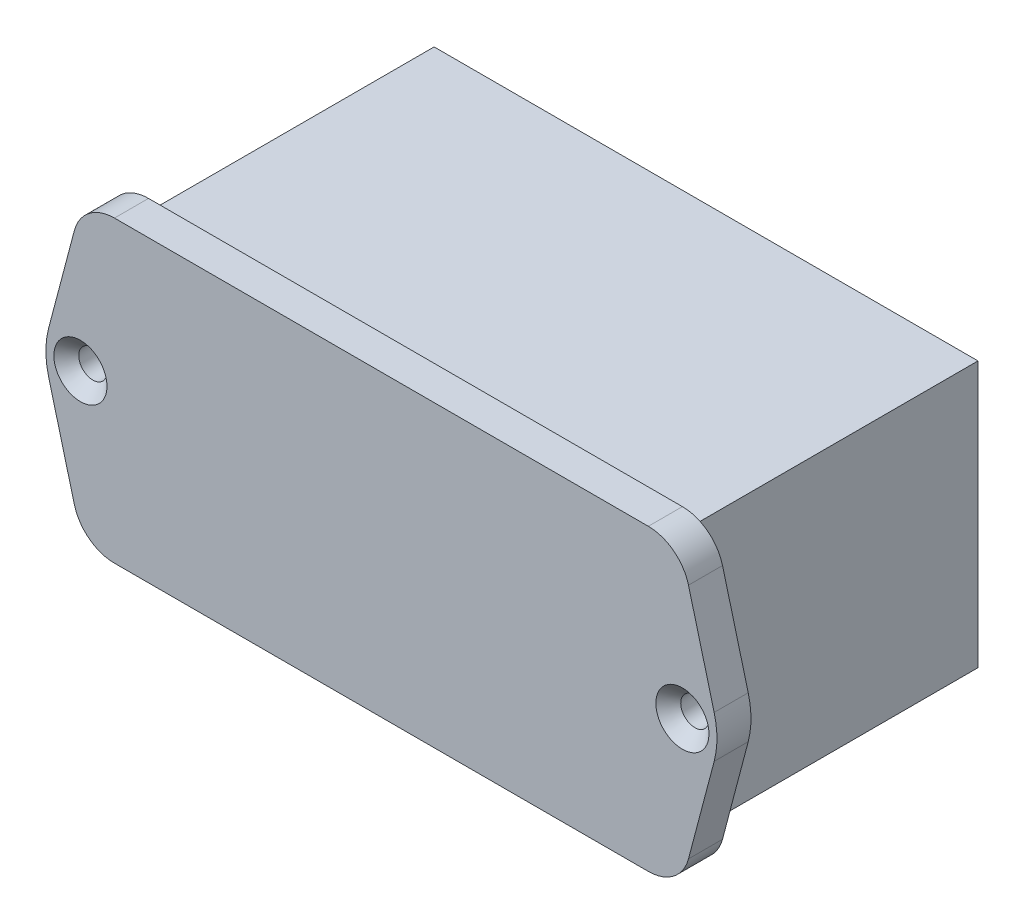
ISO-10303-21;
HEADER;
FILE_DESCRIPTION(('STEP AP214'),'2;1');
FILE_NAME('part.step','',(''),(''),'','','');
FILE_SCHEMA(('AUTOMOTIVE_DESIGN { 1 0 10303 214 1 1 1 1 }'));
ENDSEC;
DATA;
#1=APPLICATION_CONTEXT('core data for automotive mechanical design processes');
#2=APPLICATION_PROTOCOL_DEFINITION('international standard','automotive_design',2000,#1);
#3=PRODUCT_CONTEXT('',#1,'mechanical');
#4=PRODUCT('Part','Part','',(#3));
#5=PRODUCT_RELATED_PRODUCT_CATEGORY('part','',(#4));
#6=PRODUCT_DEFINITION_FORMATION('','',#4);
#7=PRODUCT_DEFINITION_CONTEXT('part definition',#1,'design');
#8=PRODUCT_DEFINITION('design','',#6,#7);
#9=PRODUCT_DEFINITION_SHAPE('','',#8);
#10=(LENGTH_UNIT() NAMED_UNIT(*) SI_UNIT(.MILLI.,.METRE.));
#11=(NAMED_UNIT(*) PLANE_ANGLE_UNIT() SI_UNIT($,.RADIAN.));
#12=(NAMED_UNIT(*) SI_UNIT($,.STERADIAN.) SOLID_ANGLE_UNIT());
#13=UNCERTAINTY_MEASURE_WITH_UNIT(LENGTH_MEASURE(1.E-05),#10,'distance_accuracy_value','');
#14=(GEOMETRIC_REPRESENTATION_CONTEXT(3) GLOBAL_UNCERTAINTY_ASSIGNED_CONTEXT((#13)) GLOBAL_UNIT_ASSIGNED_CONTEXT((#10,
#11,#12)) REPRESENTATION_CONTEXT('',''));
#15=CARTESIAN_POINT('',(0.,0.,0.));
#16=DIRECTION('',(0.,0.,1.));
#17=DIRECTION('',(1.,0.,0.));
#18=AXIS2_PLACEMENT_3D('',#15,#16,#17);
#19=CARTESIAN_POINT('',(-32.1482807802413,13.,-4.1));
#20=DIRECTION('',(0.,0.,-1.));
#21=DIRECTION('',(-1.,0.,0.));
#22=AXIS2_PLACEMENT_3D('',#19,#20,#21);
#23=PLANE('',#22);
#24=CARTESIAN_POINT('',(36.25,0.,-4.1));
#25=DIRECTION('',(0.,0.,1.));
#26=DIRECTION('',(-1.,0.,0.));
#27=AXIS2_PLACEMENT_3D('',#24,#25,#26);
#28=CIRCLE('',#27,1.7);
#29=CARTESIAN_POINT('',(34.55,0.,-4.1));
#30=VERTEX_POINT('',#29);
#31=EDGE_CURVE('E261',#30,#30,#28,.T.);
#32=ORIENTED_EDGE('',*,*,#31,.T.);
#33=EDGE_LOOP('',(#32));
#34=FACE_BOUND('',#33,.T.);
#35=CARTESIAN_POINT('',(-36.25,0.,-4.1));
#36=DIRECTION('',(0.,0.,1.));
#37=DIRECTION('',(1.,0.,0.));
#38=AXIS2_PLACEMENT_3D('',#35,#36,#37);
#39=CIRCLE('',#38,1.7);
#40=CARTESIAN_POINT('',(-34.55,0.,-4.1));
#41=VERTEX_POINT('',#40);
#42=EDGE_CURVE('E264',#41,#41,#39,.T.);
#43=ORIENTED_EDGE('',*,*,#42,.T.);
#44=EDGE_LOOP('',(#43));
#45=FACE_BOUND('',#44,.T.);
#46=CARTESIAN_POINT('',(-32.1482807802413,13.,-4.1));
#47=DIRECTION('',(0.,0.,1.));
#48=DIRECTION('',(-1.,0.,0.));
#49=AXIS2_PLACEMENT_3D('',#46,#47,#48);
#50=CIRCLE('',#49,5.);
#51=CARTESIAN_POINT('',(-32.1482807802412,18.,-4.1));
#52=VERTEX_POINT('',#51);
#53=CARTESIAN_POINT('',(-36.9827825719869,14.2757713061551,-4.1));
#54=VERTEX_POINT('',#53);
#55=EDGE_CURVE('E268',#52,#54,#50,.T.);
#56=ORIENTED_EDGE('',*,*,#55,.F.);
#57=DIRECTION('',(-1.,0.,0.));
#58=VECTOR('',#57,1.);
#59=CARTESIAN_POINT('',(32.1482807802412,18.,-4.1));
#60=LINE('',#59,#58);
#61=CARTESIAN_POINT('',(32.1482807802412,18.,-4.1));
#62=VERTEX_POINT('',#61);
#63=EDGE_CURVE('E302',#62,#52,#60,.T.);
#64=ORIENTED_EDGE('',*,*,#63,.F.);
#65=CARTESIAN_POINT('',(32.1482807802413,13.,-4.1));
#66=DIRECTION('',(0.,0.,1.));
#67=DIRECTION('',(1.,0.,0.));
#68=AXIS2_PLACEMENT_3D('',#65,#66,#67);
#69=CIRCLE('',#68,5.);
#70=CARTESIAN_POINT('',(36.9827825719869,14.2757713061551,-4.1));
#71=VERTEX_POINT('',#70);
#72=EDGE_CURVE('E299',#71,#62,#69,.T.);
#73=ORIENTED_EDGE('',*,*,#72,.F.);
#74=DIRECTION('',(-0.255154261231017,0.966900358349118,0.));
#75=VECTOR('',#74,1.);
#76=CARTESIAN_POINT('',(36.9827825719869,14.2757713061551,-4.1));
#77=LINE('',#76,#75);
#78=CARTESIAN_POINT('',(40.0766762550848,2.55154261231021,-4.1));
#79=VERTEX_POINT('',#78);
#80=EDGE_CURVE('E296',#79,#71,#77,.T.);
#81=ORIENTED_EDGE('',*,*,#80,.F.);
#82=CARTESIAN_POINT('',(30.4076726715936,0.,-4.1));
#83=DIRECTION('',(0.,0.,1.));
#84=DIRECTION('',(1.,0.,0.));
#85=AXIS2_PLACEMENT_3D('',#82,#83,#84);
#86=CIRCLE('',#85,10.);
#87=CARTESIAN_POINT('',(40.0766762550848,-2.55154261231022,-4.1));
#88=VERTEX_POINT('',#87);
#89=EDGE_CURVE('E293',#88,#79,#86,.T.);
#90=ORIENTED_EDGE('',*,*,#89,.F.);
#91=DIRECTION('',(0.255154261231018,0.966900358349118,0.));
#92=VECTOR('',#91,1.);
#93=CARTESIAN_POINT('',(36.9827825719869,-14.2757713061551,-4.1));
#94=LINE('',#93,#92);
#95=CARTESIAN_POINT('',(36.9827825719869,-14.2757713061551,-4.1));
#96=VERTEX_POINT('',#95);
#97=EDGE_CURVE('E290',#96,#88,#94,.T.);
#98=ORIENTED_EDGE('',*,*,#97,.F.);
#99=CARTESIAN_POINT('',(32.1482807802413,-13.,-4.1));
#100=DIRECTION('',(0.,0.,1.));
#101=DIRECTION('',(-1.,0.,0.));
#102=AXIS2_PLACEMENT_3D('',#99,#100,#101);
#103=CIRCLE('',#102,5.);
#104=CARTESIAN_POINT('',(32.1482807802412,-18.,-4.1));
#105=VERTEX_POINT('',#104);
#106=EDGE_CURVE('E287',#105,#96,#103,.T.);
#107=ORIENTED_EDGE('',*,*,#106,.F.);
#108=DIRECTION('',(1.,0.,0.));
#109=VECTOR('',#108,1.);
#110=CARTESIAN_POINT('',(32.1482807802412,-18.,-4.1));
#111=LINE('',#110,#109);
#112=CARTESIAN_POINT('',(-32.1482807802412,-18.,-4.1));
#113=VERTEX_POINT('',#112);
#114=EDGE_CURVE('E284',#113,#105,#111,.T.);
#115=ORIENTED_EDGE('',*,*,#114,.F.);
#116=CARTESIAN_POINT('',(-32.1482807802413,-13.,-4.1));
#117=DIRECTION('',(0.,0.,1.));
#118=DIRECTION('',(1.,0.,0.));
#119=AXIS2_PLACEMENT_3D('',#116,#117,#118);
#120=CIRCLE('',#119,5.);
#121=CARTESIAN_POINT('',(-36.9827825719869,-14.2757713061551,-4.1));
#122=VERTEX_POINT('',#121);
#123=EDGE_CURVE('E281',#122,#113,#120,.T.);
#124=ORIENTED_EDGE('',*,*,#123,.F.);
#125=DIRECTION('',(0.255154261231017,-0.966900358349119,0.));
#126=VECTOR('',#125,1.);
#127=CARTESIAN_POINT('',(-36.9827825719869,-14.2757713061551,-4.1));
#128=LINE('',#127,#126);
#129=CARTESIAN_POINT('',(-40.0766762550848,-2.55154261231022,-4.1));
#130=VERTEX_POINT('',#129);
#131=EDGE_CURVE('E278',#130,#122,#128,.T.);
#132=ORIENTED_EDGE('',*,*,#131,.F.);
#133=CARTESIAN_POINT('',(-30.4076726715936,0.,-4.1));
#134=DIRECTION('',(0.,0.,1.));
#135=DIRECTION('',(-1.,0.,0.));
#136=AXIS2_PLACEMENT_3D('',#133,#134,#135);
#137=CIRCLE('',#136,10.);
#138=CARTESIAN_POINT('',(-40.0766762550848,2.55154261231021,-4.1));
#139=VERTEX_POINT('',#138);
#140=EDGE_CURVE('E275',#139,#130,#137,.T.);
#141=ORIENTED_EDGE('',*,*,#140,.F.);
#142=DIRECTION('',(-0.255154261231017,-0.966900358349118,0.));
#143=VECTOR('',#142,1.);
#144=CARTESIAN_POINT('',(-36.9827825719869,14.2757713061551,-4.1));
#145=LINE('',#144,#143);
#146=EDGE_CURVE('E271',#54,#139,#145,.T.);
#147=ORIENTED_EDGE('',*,*,#146,.F.);
#148=EDGE_LOOP('',(#56,#64,#73,#81,#90,#98,#107,#115,#124,#132,#141,#147));
#149=FACE_BOUND('',#148,.T.);
#150=DIRECTION('',(-1.,0.,0.));
#151=VECTOR('',#150,1.);
#152=CARTESIAN_POINT('',(-32.75,-16.,-4.1));
#153=LINE('',#152,#151);
#154=CARTESIAN_POINT('',(32.75,-16.,-4.1));
#155=VERTEX_POINT('',#154);
#156=CARTESIAN_POINT('',(-32.75,-16.,-4.1));
#157=VERTEX_POINT('',#156);
#158=EDGE_CURVE('E248',#155,#157,#153,.T.);
#159=ORIENTED_EDGE('',*,*,#158,.F.);
#160=DIRECTION('',(0.,-1.,0.));
#161=VECTOR('',#160,1.);
#162=CARTESIAN_POINT('',(32.75,-16.,-4.1));
#163=LINE('',#162,#161);
#164=CARTESIAN_POINT('',(32.75,16.,-4.1));
#165=VERTEX_POINT('',#164);
#166=EDGE_CURVE('E213',#165,#155,#163,.T.);
#167=ORIENTED_EDGE('',*,*,#166,.F.);
#168=DIRECTION('',(1.,0.,0.));
#169=VECTOR('',#168,1.);
#170=CARTESIAN_POINT('',(-32.75,16.,-4.1));
#171=LINE('',#170,#169);
#172=CARTESIAN_POINT('',(-32.75,16.,-4.1));
#173=VERTEX_POINT('',#172);
#174=EDGE_CURVE('E239',#173,#165,#171,.T.);
#175=ORIENTED_EDGE('',*,*,#174,.F.);
#176=DIRECTION('',(0.,1.,0.));
#177=VECTOR('',#176,1.);
#178=CARTESIAN_POINT('',(-32.75,-16.,-4.1));
#179=LINE('',#178,#177);
#180=EDGE_CURVE('E250',#157,#173,#179,.T.);
#181=ORIENTED_EDGE('',*,*,#180,.F.);
#182=EDGE_LOOP('',(#159,#167,#175,#181));
#183=FACE_BOUND('',#182,.T.);
#184=ADVANCED_FACE('F57',(#34,#45,#149,#183),#23,.T.);
#185=CARTESIAN_POINT('',(-32.1482807802413,13.,-4.1));
#186=DIRECTION('',(0.,0.,1.));
#187=DIRECTION('',(1.,0.,0.));
#188=AXIS2_PLACEMENT_3D('',#185,#186,#187);
#189=CYLINDRICAL_SURFACE('',#188,5.);
#190=CARTESIAN_POINT('',(-32.1482807802413,13.,0.));
#191=DIRECTION('',(0.,0.,1.));
#192=DIRECTION('',(-1.,0.,0.));
#193=AXIS2_PLACEMENT_3D('',#190,#191,#192);
#194=CIRCLE('',#193,5.);
#195=CARTESIAN_POINT('',(-32.1482807802412,18.,0.));
#196=VERTEX_POINT('',#195);
#197=CARTESIAN_POINT('',(-36.9827825719869,14.2757713061551,0.));
#198=VERTEX_POINT('',#197);
#199=EDGE_CURVE('E267',#196,#198,#194,.T.);
#200=ORIENTED_EDGE('',*,*,#199,.F.);
#201=DIRECTION('',(0.,0.,1.));
#202=VECTOR('',#201,1.);
#203=CARTESIAN_POINT('',(-32.1482807802412,18.,-4.1));
#204=LINE('',#203,#202);
#205=EDGE_CURVE('E340',#52,#196,#204,.T.);
#206=ORIENTED_EDGE('',*,*,#205,.F.);
#207=ORIENTED_EDGE('',*,*,#55,.T.);
#208=DIRECTION('',(0.,0.,1.));
#209=VECTOR('',#208,1.);
#210=CARTESIAN_POINT('',(-36.9827825719869,14.2757713061551,-4.1));
#211=LINE('',#210,#209);
#212=EDGE_CURVE('E305',#54,#198,#211,.T.);
#213=ORIENTED_EDGE('',*,*,#212,.T.);
#214=EDGE_LOOP('',(#200,#206,#207,#213));
#215=FACE_BOUND('',#214,.T.);
#216=ADVANCED_FACE('F389',(#215),#189,.T.);
#217=CARTESIAN_POINT('',(32.1482807802412,18.,-4.1));
#218=DIRECTION('',(0.,1.,0.));
#219=DIRECTION('',(0.,0.,1.));
#220=AXIS2_PLACEMENT_3D('',#217,#218,#219);
#221=PLANE('',#220);
#222=DIRECTION('',(-1.,0.,0.));
#223=VECTOR('',#222,1.);
#224=CARTESIAN_POINT('',(32.1482807802412,18.,0.));
#225=LINE('',#224,#223);
#226=CARTESIAN_POINT('',(32.1482807802412,18.,0.));
#227=VERTEX_POINT('',#226);
#228=EDGE_CURVE('E272',#227,#196,#225,.T.);
#229=ORIENTED_EDGE('',*,*,#228,.F.);
#230=DIRECTION('',(0.,0.,1.));
#231=VECTOR('',#230,1.);
#232=CARTESIAN_POINT('',(32.1482807802412,18.,-4.1));
#233=LINE('',#232,#231);
#234=EDGE_CURVE('E343',#62,#227,#233,.T.);
#235=ORIENTED_EDGE('',*,*,#234,.F.);
#236=ORIENTED_EDGE('',*,*,#63,.T.);
#237=ORIENTED_EDGE('',*,*,#205,.T.);
#238=EDGE_LOOP('',(#229,#235,#236,#237));
#239=FACE_BOUND('',#238,.T.);
#240=ADVANCED_FACE('F436',(#239),#221,.T.);
#241=CARTESIAN_POINT('',(32.1482807802413,13.,-4.1));
#242=DIRECTION('',(0.,0.,1.));
#243=DIRECTION('',(1.,0.,0.));
#244=AXIS2_PLACEMENT_3D('',#241,#242,#243);
#245=CYLINDRICAL_SURFACE('',#244,5.);
#246=CARTESIAN_POINT('',(32.1482807802413,13.,0.));
#247=DIRECTION('',(0.,0.,1.));
#248=DIRECTION('',(1.,0.,0.));
#249=AXIS2_PLACEMENT_3D('',#246,#247,#248);
#250=CIRCLE('',#249,5.);
#251=CARTESIAN_POINT('',(36.9827825719869,14.2757713061551,0.));
#252=VERTEX_POINT('',#251);
#253=EDGE_CURVE('E335',#252,#227,#250,.T.);
#254=ORIENTED_EDGE('',*,*,#253,.F.);
#255=DIRECTION('',(0.,0.,1.));
#256=VECTOR('',#255,1.);
#257=CARTESIAN_POINT('',(36.9827825719869,14.2757713061551,-4.1));
#258=LINE('',#257,#256);
#259=EDGE_CURVE('E345',#71,#252,#258,.T.);
#260=ORIENTED_EDGE('',*,*,#259,.F.);
#261=ORIENTED_EDGE('',*,*,#72,.T.);
#262=ORIENTED_EDGE('',*,*,#234,.T.);
#263=EDGE_LOOP('',(#254,#260,#261,#262));
#264=FACE_BOUND('',#263,.T.);
#265=ADVANCED_FACE('F439',(#264),#245,.T.);
#266=CARTESIAN_POINT('',(36.9827825719869,14.2757713061551,-4.1));
#267=DIRECTION('',(0.966900358349119,0.255154261231017,0.));
#268=DIRECTION('',(-0.255154261231017,0.966900358349119,0.));
#269=AXIS2_PLACEMENT_3D('',#266,#267,#268);
#270=PLANE('',#269);
#271=DIRECTION('',(-0.255154261231017,0.966900358349118,0.));
#272=VECTOR('',#271,1.);
#273=CARTESIAN_POINT('',(36.9827825719869,14.2757713061551,0.));
#274=LINE('',#273,#272);
#275=CARTESIAN_POINT('',(40.0766762550848,2.55154261231021,0.));
#276=VERTEX_POINT('',#275);
#277=EDGE_CURVE('E332',#276,#252,#274,.T.);
#278=ORIENTED_EDGE('',*,*,#277,.F.);
#279=DIRECTION('',(0.,0.,1.));
#280=VECTOR('',#279,1.);
#281=CARTESIAN_POINT('',(40.0766762550848,2.55154261231021,-4.1));
#282=LINE('',#281,#280);
#283=EDGE_CURVE('E347',#79,#276,#282,.T.);
#284=ORIENTED_EDGE('',*,*,#283,.F.);
#285=ORIENTED_EDGE('',*,*,#80,.T.);
#286=ORIENTED_EDGE('',*,*,#259,.T.);
#287=EDGE_LOOP('',(#278,#284,#285,#286));
#288=FACE_BOUND('',#287,.T.);
#289=ADVANCED_FACE('F443',(#288),#270,.T.);
#290=CARTESIAN_POINT('',(30.4076726715936,0.,-4.1));
#291=DIRECTION('',(0.,0.,1.));
#292=DIRECTION('',(1.,0.,0.));
#293=AXIS2_PLACEMENT_3D('',#290,#291,#292);
#294=CYLINDRICAL_SURFACE('',#293,10.);
#295=CARTESIAN_POINT('',(30.4076726715936,0.,0.));
#296=DIRECTION('',(0.,0.,1.));
#297=DIRECTION('',(1.,0.,0.));
#298=AXIS2_PLACEMENT_3D('',#295,#296,#297);
#299=CIRCLE('',#298,10.);
#300=CARTESIAN_POINT('',(40.0766762550848,-2.55154261231022,0.));
#301=VERTEX_POINT('',#300);
#302=EDGE_CURVE('E329',#301,#276,#299,.T.);
#303=ORIENTED_EDGE('',*,*,#302,.F.);
#304=DIRECTION('',(0.,0.,1.));
#305=VECTOR('',#304,1.);
#306=CARTESIAN_POINT('',(40.0766762550848,-2.55154261231022,-4.1));
#307=LINE('',#306,#305);
#308=EDGE_CURVE('E349',#88,#301,#307,.T.);
#309=ORIENTED_EDGE('',*,*,#308,.F.);
#310=ORIENTED_EDGE('',*,*,#89,.T.);
#311=ORIENTED_EDGE('',*,*,#283,.T.);
#312=EDGE_LOOP('',(#303,#309,#310,#311));
#313=FACE_BOUND('',#312,.T.);
#314=ADVANCED_FACE('F447',(#313),#294,.T.);
#315=CARTESIAN_POINT('',(36.9827825719869,-14.2757713061551,-4.1));
#316=DIRECTION('',(0.966900358349118,-0.255154261231018,0.));
#317=DIRECTION('',(0.255154261231018,0.966900358349119,0.));
#318=AXIS2_PLACEMENT_3D('',#315,#316,#317);
#319=PLANE('',#318);
#320=DIRECTION('',(0.255154261231018,0.966900358349118,0.));
#321=VECTOR('',#320,1.);
#322=CARTESIAN_POINT('',(36.9827825719869,-14.2757713061551,0.));
#323=LINE('',#322,#321);
#324=CARTESIAN_POINT('',(36.9827825719869,-14.2757713061551,0.));
#325=VERTEX_POINT('',#324);
#326=EDGE_CURVE('E326',#325,#301,#323,.T.);
#327=ORIENTED_EDGE('',*,*,#326,.F.);
#328=DIRECTION('',(0.,0.,1.));
#329=VECTOR('',#328,1.);
#330=CARTESIAN_POINT('',(36.9827825719869,-14.2757713061551,-4.1));
#331=LINE('',#330,#329);
#332=EDGE_CURVE('E351',#96,#325,#331,.T.);
#333=ORIENTED_EDGE('',*,*,#332,.F.);
#334=ORIENTED_EDGE('',*,*,#97,.T.);
#335=ORIENTED_EDGE('',*,*,#308,.T.);
#336=EDGE_LOOP('',(#327,#333,#334,#335));
#337=FACE_BOUND('',#336,.T.);
#338=ADVANCED_FACE('F451',(#337),#319,.T.);
#339=CARTESIAN_POINT('',(32.1482807802413,-13.,-4.1));
#340=DIRECTION('',(0.,0.,1.));
#341=DIRECTION('',(1.,0.,0.));
#342=AXIS2_PLACEMENT_3D('',#339,#340,#341);
#343=CYLINDRICAL_SURFACE('',#342,5.);
#344=CARTESIAN_POINT('',(32.1482807802413,-13.,0.));
#345=DIRECTION('',(0.,0.,1.));
#346=DIRECTION('',(-1.,0.,0.));
#347=AXIS2_PLACEMENT_3D('',#344,#345,#346);
#348=CIRCLE('',#347,5.);
#349=CARTESIAN_POINT('',(32.1482807802412,-18.,0.));
#350=VERTEX_POINT('',#349);
#351=EDGE_CURVE('E323',#350,#325,#348,.T.);
#352=ORIENTED_EDGE('',*,*,#351,.F.);
#353=DIRECTION('',(0.,0.,1.));
#354=VECTOR('',#353,1.);
#355=CARTESIAN_POINT('',(32.1482807802412,-18.,-4.1));
#356=LINE('',#355,#354);
#357=EDGE_CURVE('E353',#105,#350,#356,.T.);
#358=ORIENTED_EDGE('',*,*,#357,.F.);
#359=ORIENTED_EDGE('',*,*,#106,.T.);
#360=ORIENTED_EDGE('',*,*,#332,.T.);
#361=EDGE_LOOP('',(#352,#358,#359,#360));
#362=FACE_BOUND('',#361,.T.);
#363=ADVANCED_FACE('F455',(#362),#343,.T.);
#364=CARTESIAN_POINT('',(32.1482807802412,-18.,-4.1));
#365=DIRECTION('',(0.,-1.,0.));
#366=DIRECTION('',(1.,0.,0.));
#367=AXIS2_PLACEMENT_3D('',#364,#365,#366);
#368=PLANE('',#367);
#369=DIRECTION('',(1.,0.,0.));
#370=VECTOR('',#369,1.);
#371=CARTESIAN_POINT('',(32.1482807802412,-18.,0.));
#372=LINE('',#371,#370);
#373=CARTESIAN_POINT('',(-32.1482807802412,-18.,0.));
#374=VERTEX_POINT('',#373);
#375=EDGE_CURVE('E320',#374,#350,#372,.T.);
#376=ORIENTED_EDGE('',*,*,#375,.F.);
#377=DIRECTION('',(0.,0.,1.));
#378=VECTOR('',#377,1.);
#379=CARTESIAN_POINT('',(-32.1482807802412,-18.,-4.1));
#380=LINE('',#379,#378);
#381=EDGE_CURVE('E355',#113,#374,#380,.T.);
#382=ORIENTED_EDGE('',*,*,#381,.F.);
#383=ORIENTED_EDGE('',*,*,#114,.T.);
#384=ORIENTED_EDGE('',*,*,#357,.T.);
#385=EDGE_LOOP('',(#376,#382,#383,#384));
#386=FACE_BOUND('',#385,.T.);
#387=ADVANCED_FACE('F459',(#386),#368,.T.);
#388=CARTESIAN_POINT('',(-32.1482807802413,-13.,-4.1));
#389=DIRECTION('',(0.,0.,1.));
#390=DIRECTION('',(1.,0.,0.));
#391=AXIS2_PLACEMENT_3D('',#388,#389,#390);
#392=CYLINDRICAL_SURFACE('',#391,5.);
#393=CARTESIAN_POINT('',(-32.1482807802413,-13.,0.));
#394=DIRECTION('',(0.,0.,1.));
#395=DIRECTION('',(1.,0.,0.));
#396=AXIS2_PLACEMENT_3D('',#393,#394,#395);
#397=CIRCLE('',#396,5.);
#398=CARTESIAN_POINT('',(-36.9827825719869,-14.2757713061551,0.));
#399=VERTEX_POINT('',#398);
#400=EDGE_CURVE('E317',#399,#374,#397,.T.);
#401=ORIENTED_EDGE('',*,*,#400,.F.);
#402=DIRECTION('',(0.,0.,1.));
#403=VECTOR('',#402,1.);
#404=CARTESIAN_POINT('',(-36.9827825719869,-14.2757713061551,-4.1));
#405=LINE('',#404,#403);
#406=EDGE_CURVE('E357',#122,#399,#405,.T.);
#407=ORIENTED_EDGE('',*,*,#406,.F.);
#408=ORIENTED_EDGE('',*,*,#123,.T.);
#409=ORIENTED_EDGE('',*,*,#381,.T.);
#410=EDGE_LOOP('',(#401,#407,#408,#409));
#411=FACE_BOUND('',#410,.T.);
#412=ADVANCED_FACE('F463',(#411),#392,.T.);
#413=CARTESIAN_POINT('',(-36.9827825719869,-14.2757713061551,-4.1));
#414=DIRECTION('',(-0.966900358349119,-0.255154261231017,0.));
#415=DIRECTION('',(0.255154261231017,-0.966900358349119,0.));
#416=AXIS2_PLACEMENT_3D('',#413,#414,#415);
#417=PLANE('',#416);
#418=DIRECTION('',(0.255154261231017,-0.966900358349119,0.));
#419=VECTOR('',#418,1.);
#420=CARTESIAN_POINT('',(-36.9827825719869,-14.2757713061551,0.));
#421=LINE('',#420,#419);
#422=CARTESIAN_POINT('',(-40.0766762550848,-2.55154261231022,0.));
#423=VERTEX_POINT('',#422);
#424=EDGE_CURVE('E314',#423,#399,#421,.T.);
#425=ORIENTED_EDGE('',*,*,#424,.F.);
#426=DIRECTION('',(0.,0.,1.));
#427=VECTOR('',#426,1.);
#428=CARTESIAN_POINT('',(-40.0766762550848,-2.55154261231022,-4.1));
#429=LINE('',#428,#427);
#430=EDGE_CURVE('E359',#130,#423,#429,.T.);
#431=ORIENTED_EDGE('',*,*,#430,.F.);
#432=ORIENTED_EDGE('',*,*,#131,.T.);
#433=ORIENTED_EDGE('',*,*,#406,.T.);
#434=EDGE_LOOP('',(#425,#431,#432,#433));
#435=FACE_BOUND('',#434,.T.);
#436=ADVANCED_FACE('F467',(#435),#417,.T.);
#437=CARTESIAN_POINT('',(-30.4076726715936,0.,-4.1));
#438=DIRECTION('',(0.,0.,1.));
#439=DIRECTION('',(1.,0.,0.));
#440=AXIS2_PLACEMENT_3D('',#437,#438,#439);
#441=CYLINDRICAL_SURFACE('',#440,10.);
#442=CARTESIAN_POINT('',(-30.4076726715936,0.,0.));
#443=DIRECTION('',(0.,0.,1.));
#444=DIRECTION('',(-1.,0.,0.));
#445=AXIS2_PLACEMENT_3D('',#442,#443,#444);
#446=CIRCLE('',#445,10.);
#447=CARTESIAN_POINT('',(-40.0766762550848,2.55154261231021,0.));
#448=VERTEX_POINT('',#447);
#449=EDGE_CURVE('E311',#448,#423,#446,.T.);
#450=ORIENTED_EDGE('',*,*,#449,.F.);
#451=DIRECTION('',(0.,0.,1.));
#452=VECTOR('',#451,1.);
#453=CARTESIAN_POINT('',(-40.0766762550848,2.55154261231021,-4.1));
#454=LINE('',#453,#452);
#455=EDGE_CURVE('E361',#139,#448,#454,.T.);
#456=ORIENTED_EDGE('',*,*,#455,.F.);
#457=ORIENTED_EDGE('',*,*,#140,.T.);
#458=ORIENTED_EDGE('',*,*,#430,.T.);
#459=EDGE_LOOP('',(#450,#456,#457,#458));
#460=FACE_BOUND('',#459,.T.);
#461=ADVANCED_FACE('F471',(#460),#441,.T.);
#462=CARTESIAN_POINT('',(-36.9827825719869,14.2757713061551,-4.1));
#463=DIRECTION('',(-0.966900358349119,0.255154261231017,0.));
#464=DIRECTION('',(-0.255154261231017,-0.966900358349119,0.));
#465=AXIS2_PLACEMENT_3D('',#462,#463,#464);
#466=PLANE('',#465);
#467=DIRECTION('',(-0.255154261231017,-0.966900358349118,0.));
#468=VECTOR('',#467,1.);
#469=CARTESIAN_POINT('',(-36.9827825719869,14.2757713061551,0.));
#470=LINE('',#469,#468);
#471=EDGE_CURVE('E308',#198,#448,#470,.T.);
#472=ORIENTED_EDGE('',*,*,#471,.F.);
#473=ORIENTED_EDGE('',*,*,#212,.F.);
#474=ORIENTED_EDGE('',*,*,#146,.T.);
#475=ORIENTED_EDGE('',*,*,#455,.T.);
#476=EDGE_LOOP('',(#472,#473,#474,#475));
#477=FACE_BOUND('',#476,.T.);
#478=ADVANCED_FACE('F435',(#477),#466,.T.);
#479=CARTESIAN_POINT('',(-32.1482807802413,13.,0.));
#480=DIRECTION('',(0.,0.,-1.));
#481=DIRECTION('',(-1.,0.,0.));
#482=AXIS2_PLACEMENT_3D('',#479,#480,#481);
#483=PLANE('',#482);
#484=CARTESIAN_POINT('',(36.25,0.,0.));
#485=DIRECTION('',(0.,0.,-1.));
#486=DIRECTION('',(-1.,0.,0.));
#487=AXIS2_PLACEMENT_3D('',#484,#485,#486);
#488=CIRCLE('',#487,3.20000000000001);
#489=CARTESIAN_POINT('',(33.05,0.,0.));
#490=VERTEX_POINT('',#489);
#491=EDGE_CURVE('E65',#490,#490,#488,.T.);
#492=ORIENTED_EDGE('',*,*,#491,.T.);
#493=EDGE_LOOP('',(#492));
#494=FACE_BOUND('',#493,.T.);
#495=CARTESIAN_POINT('',(-36.25,0.,0.));
#496=DIRECTION('',(0.,0.,-1.));
#497=DIRECTION('',(-1.,0.,0.));
#498=AXIS2_PLACEMENT_3D('',#495,#496,#497);
#499=CIRCLE('',#498,3.20000000000001);
#500=CARTESIAN_POINT('',(-39.45,0.,0.));
#501=VERTEX_POINT('',#500);
#502=EDGE_CURVE('E366',#501,#501,#499,.T.);
#503=ORIENTED_EDGE('',*,*,#502,.T.);
#504=EDGE_LOOP('',(#503));
#505=FACE_BOUND('',#504,.T.);
#506=ORIENTED_EDGE('',*,*,#199,.T.);
#507=ORIENTED_EDGE('',*,*,#471,.T.);
#508=ORIENTED_EDGE('',*,*,#449,.T.);
#509=ORIENTED_EDGE('',*,*,#424,.T.);
#510=ORIENTED_EDGE('',*,*,#400,.T.);
#511=ORIENTED_EDGE('',*,*,#375,.T.);
#512=ORIENTED_EDGE('',*,*,#351,.T.);
#513=ORIENTED_EDGE('',*,*,#326,.T.);
#514=ORIENTED_EDGE('',*,*,#302,.T.);
#515=ORIENTED_EDGE('',*,*,#277,.T.);
#516=ORIENTED_EDGE('',*,*,#253,.T.);
#517=ORIENTED_EDGE('',*,*,#228,.T.);
#518=EDGE_LOOP('',(#506,#507,#508,#509,#510,#511,#512,#513,#514,#515,#516,#517));
#519=FACE_BOUND('',#518,.T.);
#520=ADVANCED_FACE('F371',(#494,#505,#519),#483,.F.);
#521=CARTESIAN_POINT('',(-36.25,0.,-4.1));
#522=DIRECTION('',(0.,0.,1.));
#523=DIRECTION('',(1.,0.,0.));
#524=AXIS2_PLACEMENT_3D('',#521,#522,#523);
#525=CYLINDRICAL_SURFACE('',#524,1.7);
#526=CARTESIAN_POINT('',(-36.25,0.,-1.5));
#527=DIRECTION('',(0.,0.,-1.));
#528=DIRECTION('',(-1.,0.,0.));
#529=AXIS2_PLACEMENT_3D('',#526,#527,#528);
#530=CIRCLE('',#529,1.7);
#531=CARTESIAN_POINT('',(-37.95,0.,-1.5));
#532=VERTEX_POINT('',#531);
#533=EDGE_CURVE('E12',#532,#532,#530,.F.);
#534=ORIENTED_EDGE('',*,*,#533,.T.);
#535=EDGE_LOOP('',(#534));
#536=FACE_BOUND('',#535,.T.);
#537=ORIENTED_EDGE('',*,*,#42,.F.);
#538=EDGE_LOOP('',(#537));
#539=FACE_BOUND('',#538,.T.);
#540=ADVANCED_FACE('F383',(#536,#539),#525,.F.);
#541=CARTESIAN_POINT('',(36.25,0.,-4.1));
#542=DIRECTION('',(0.,0.,1.));
#543=DIRECTION('',(1.,0.,0.));
#544=AXIS2_PLACEMENT_3D('',#541,#542,#543);
#545=CYLINDRICAL_SURFACE('',#544,1.7);
#546=CARTESIAN_POINT('',(36.25,0.,-1.5));
#547=DIRECTION('',(0.,0.,-1.));
#548=DIRECTION('',(-1.,0.,0.));
#549=AXIS2_PLACEMENT_3D('',#546,#547,#548);
#550=CIRCLE('',#549,1.7);
#551=CARTESIAN_POINT('',(34.55,0.,-1.5));
#552=VERTEX_POINT('',#551);
#553=EDGE_CURVE('E342',#552,#552,#550,.F.);
#554=ORIENTED_EDGE('',*,*,#553,.T.);
#555=EDGE_LOOP('',(#554));
#556=FACE_BOUND('',#555,.T.);
#557=ORIENTED_EDGE('',*,*,#31,.F.);
#558=EDGE_LOOP('',(#557));
#559=FACE_BOUND('',#558,.T.);
#560=ADVANCED_FACE('F380',(#556,#559),#545,.F.);
#561=CARTESIAN_POINT('',(0.,0.,-39.1));
#562=DIRECTION('',(0.,0.,-1.));
#563=DIRECTION('',(-1.,0.,0.));
#564=AXIS2_PLACEMENT_3D('',#561,#562,#563);
#565=PLANE('',#564);
#566=DIRECTION('',(0.,-1.,0.));
#567=VECTOR('',#566,1.);
#568=CARTESIAN_POINT('',(32.75,-16.,-39.1));
#569=LINE('',#568,#567);
#570=CARTESIAN_POINT('',(32.75,16.,-39.1));
#571=VERTEX_POINT('',#570);
#572=CARTESIAN_POINT('',(32.75,-16.,-39.1));
#573=VERTEX_POINT('',#572);
#574=EDGE_CURVE('E235',#571,#573,#569,.T.);
#575=ORIENTED_EDGE('',*,*,#574,.T.);
#576=DIRECTION('',(-1.,0.,0.));
#577=VECTOR('',#576,1.);
#578=CARTESIAN_POINT('',(-32.75,-16.,-39.1));
#579=LINE('',#578,#577);
#580=CARTESIAN_POINT('',(-32.75,-16.,-39.1));
#581=VERTEX_POINT('',#580);
#582=EDGE_CURVE('E238',#573,#581,#579,.T.);
#583=ORIENTED_EDGE('',*,*,#582,.T.);
#584=DIRECTION('',(0.,1.,0.));
#585=VECTOR('',#584,1.);
#586=CARTESIAN_POINT('',(-32.75,-16.,-39.1));
#587=LINE('',#586,#585);
#588=CARTESIAN_POINT('',(-32.75,16.,-39.1));
#589=VERTEX_POINT('',#588);
#590=EDGE_CURVE('E241',#581,#589,#587,.T.);
#591=ORIENTED_EDGE('',*,*,#590,.T.);
#592=DIRECTION('',(1.,0.,0.));
#593=VECTOR('',#592,1.);
#594=CARTESIAN_POINT('',(-32.75,16.,-39.1));
#595=LINE('',#594,#593);
#596=EDGE_CURVE('E243',#589,#571,#595,.T.);
#597=ORIENTED_EDGE('',*,*,#596,.T.);
#598=EDGE_LOOP('',(#575,#583,#591,#597));
#599=FACE_BOUND('',#598,.T.);
#600=DIRECTION('',(-1.,0.,0.));
#601=VECTOR('',#600,1.);
#602=CARTESIAN_POINT('',(-32.75,-15.,-39.1));
#603=LINE('',#602,#601);
#604=CARTESIAN_POINT('',(31.75,-15.,-39.1));
#605=VERTEX_POINT('',#604);
#606=CARTESIAN_POINT('',(-31.75,-15.,-39.1));
#607=VERTEX_POINT('',#606);
#608=EDGE_CURVE('E205',#605,#607,#603,.T.);
#609=ORIENTED_EDGE('',*,*,#608,.F.);
#610=DIRECTION('',(0.,-1.,0.));
#611=VECTOR('',#610,1.);
#612=CARTESIAN_POINT('',(31.75,-16.,-39.1));
#613=LINE('',#612,#611);
#614=CARTESIAN_POINT('',(31.75,15.,-39.1));
#615=VERTEX_POINT('',#614);
#616=EDGE_CURVE('E196',#615,#605,#613,.T.);
#617=ORIENTED_EDGE('',*,*,#616,.F.);
#618=DIRECTION('',(1.,0.,0.));
#619=VECTOR('',#618,1.);
#620=CARTESIAN_POINT('',(-32.75,15.,-39.1));
#621=LINE('',#620,#619);
#622=CARTESIAN_POINT('',(-31.75,15.,-39.1));
#623=VERTEX_POINT('',#622);
#624=EDGE_CURVE('E221',#623,#615,#621,.T.);
#625=ORIENTED_EDGE('',*,*,#624,.F.);
#626=DIRECTION('',(0.,1.,0.));
#627=VECTOR('',#626,1.);
#628=CARTESIAN_POINT('',(-31.75,-16.,-39.1));
#629=LINE('',#628,#627);
#630=EDGE_CURVE('E219',#607,#623,#629,.T.);
#631=ORIENTED_EDGE('',*,*,#630,.F.);
#632=EDGE_LOOP('',(#609,#617,#625,#631));
#633=FACE_BOUND('',#632,.T.);
#634=ADVANCED_FACE('F217',(#599,#633),#565,.T.);
#635=CARTESIAN_POINT('',(32.75,-16.,-39.1));
#636=DIRECTION('',(-1.,0.,0.));
#637=DIRECTION('',(0.,0.,1.));
#638=AXIS2_PLACEMENT_3D('',#635,#636,#637);
#639=PLANE('',#638);
#640=ORIENTED_EDGE('',*,*,#166,.T.);
#641=DIRECTION('',(0.,0.,1.));
#642=VECTOR('',#641,1.);
#643=CARTESIAN_POINT('',(32.75,-16.,-39.1));
#644=LINE('',#643,#642);
#645=EDGE_CURVE('E259',#573,#155,#644,.T.);
#646=ORIENTED_EDGE('',*,*,#645,.F.);
#647=ORIENTED_EDGE('',*,*,#574,.F.);
#648=DIRECTION('',(0.,0.,1.));
#649=VECTOR('',#648,1.);
#650=CARTESIAN_POINT('',(32.75,16.,-39.1));
#651=LINE('',#650,#649);
#652=EDGE_CURVE('E245',#571,#165,#651,.T.);
#653=ORIENTED_EDGE('',*,*,#652,.T.);
#654=EDGE_LOOP('',(#640,#646,#647,#653));
#655=FACE_BOUND('',#654,.T.);
#656=ADVANCED_FACE('F412',(#655),#639,.F.);
#657=CARTESIAN_POINT('',(-32.75,-16.,-39.1));
#658=DIRECTION('',(0.,1.,0.));
#659=DIRECTION('',(-1.,0.,0.));
#660=AXIS2_PLACEMENT_3D('',#657,#658,#659);
#661=PLANE('',#660);
#662=ORIENTED_EDGE('',*,*,#158,.T.);
#663=DIRECTION('',(0.,0.,1.));
#664=VECTOR('',#663,1.);
#665=CARTESIAN_POINT('',(-32.75,-16.,-39.1));
#666=LINE('',#665,#664);
#667=EDGE_CURVE('E256',#581,#157,#666,.T.);
#668=ORIENTED_EDGE('',*,*,#667,.F.);
#669=ORIENTED_EDGE('',*,*,#582,.F.);
#670=ORIENTED_EDGE('',*,*,#645,.T.);
#671=EDGE_LOOP('',(#662,#668,#669,#670));
#672=FACE_BOUND('',#671,.T.);
#673=ADVANCED_FACE('F403',(#672),#661,.F.);
#674=CARTESIAN_POINT('',(-32.75,-16.,-39.1));
#675=DIRECTION('',(1.,0.,0.));
#676=DIRECTION('',(0.,0.,-1.));
#677=AXIS2_PLACEMENT_3D('',#674,#675,#676);
#678=PLANE('',#677);
#679=ORIENTED_EDGE('',*,*,#180,.T.);
#680=DIRECTION('',(0.,0.,1.));
#681=VECTOR('',#680,1.);
#682=CARTESIAN_POINT('',(-32.75,16.,-39.1));
#683=LINE('',#682,#681);
#684=EDGE_CURVE('E72',#589,#173,#683,.T.);
#685=ORIENTED_EDGE('',*,*,#684,.F.);
#686=ORIENTED_EDGE('',*,*,#590,.F.);
#687=ORIENTED_EDGE('',*,*,#667,.T.);
#688=EDGE_LOOP('',(#679,#685,#686,#687));
#689=FACE_BOUND('',#688,.T.);
#690=ADVANCED_FACE('F407',(#689),#678,.F.);
#691=CARTESIAN_POINT('',(-32.75,16.,-39.1));
#692=DIRECTION('',(0.,-1.,0.));
#693=DIRECTION('',(1.,0.,0.));
#694=AXIS2_PLACEMENT_3D('',#691,#692,#693);
#695=PLANE('',#694);
#696=ORIENTED_EDGE('',*,*,#174,.T.);
#697=ORIENTED_EDGE('',*,*,#652,.F.);
#698=ORIENTED_EDGE('',*,*,#596,.F.);
#699=ORIENTED_EDGE('',*,*,#684,.T.);
#700=EDGE_LOOP('',(#696,#697,#698,#699));
#701=FACE_BOUND('',#700,.T.);
#702=ADVANCED_FACE('F413',(#701),#695,.F.);
#703=CARTESIAN_POINT('',(31.75,-16.,-39.1));
#704=DIRECTION('',(-1.,0.,0.));
#705=DIRECTION('',(0.,0.,1.));
#706=AXIS2_PLACEMENT_3D('',#703,#704,#705);
#707=PLANE('',#706);
#708=DIRECTION('',(0.,-1.,0.));
#709=VECTOR('',#708,1.);
#710=CARTESIAN_POINT('',(31.75,-16.,-4.1));
#711=LINE('',#710,#709);
#712=CARTESIAN_POINT('',(31.75,15.,-4.1));
#713=VERTEX_POINT('',#712);
#714=CARTESIAN_POINT('',(31.75,-15.,-4.1));
#715=VERTEX_POINT('',#714);
#716=EDGE_CURVE('E80',#713,#715,#711,.T.);
#717=ORIENTED_EDGE('',*,*,#716,.F.);
#718=DIRECTION('',(0.,0.,1.));
#719=VECTOR('',#718,1.);
#720=CARTESIAN_POINT('',(31.75,15.,-39.1));
#721=LINE('',#720,#719);
#722=EDGE_CURVE('E201',#615,#713,#721,.T.);
#723=ORIENTED_EDGE('',*,*,#722,.F.);
#724=ORIENTED_EDGE('',*,*,#616,.T.);
#725=DIRECTION('',(0.,0.,1.));
#726=VECTOR('',#725,1.);
#727=CARTESIAN_POINT('',(31.75,-15.,-39.1));
#728=LINE('',#727,#726);
#729=EDGE_CURVE('E199',#605,#715,#728,.T.);
#730=ORIENTED_EDGE('',*,*,#729,.T.);
#731=EDGE_LOOP('',(#717,#723,#724,#730));
#732=FACE_BOUND('',#731,.T.);
#733=ADVANCED_FACE('F198',(#732),#707,.T.);
#734=CARTESIAN_POINT('',(-32.75,-15.,-39.1));
#735=DIRECTION('',(0.,1.,0.));
#736=DIRECTION('',(-1.,0.,0.));
#737=AXIS2_PLACEMENT_3D('',#734,#735,#736);
#738=PLANE('',#737);
#739=DIRECTION('',(-1.,0.,0.));
#740=VECTOR('',#739,1.);
#741=CARTESIAN_POINT('',(-32.75,-15.,-4.1));
#742=LINE('',#741,#740);
#743=CARTESIAN_POINT('',(-31.75,-15.,-4.1));
#744=VERTEX_POINT('',#743);
#745=EDGE_CURVE('E212',#715,#744,#742,.T.);
#746=ORIENTED_EDGE('',*,*,#745,.F.);
#747=ORIENTED_EDGE('',*,*,#729,.F.);
#748=ORIENTED_EDGE('',*,*,#608,.T.);
#749=DIRECTION('',(0.,0.,1.));
#750=VECTOR('',#749,1.);
#751=CARTESIAN_POINT('',(-31.75,-15.,-39.1));
#752=LINE('',#751,#750);
#753=EDGE_CURVE('E214',#607,#744,#752,.T.);
#754=ORIENTED_EDGE('',*,*,#753,.T.);
#755=EDGE_LOOP('',(#746,#747,#748,#754));
#756=FACE_BOUND('',#755,.T.);
#757=ADVANCED_FACE('F209',(#756),#738,.T.);
#758=CARTESIAN_POINT('',(-31.75,-16.,-39.1));
#759=DIRECTION('',(1.,0.,0.));
#760=DIRECTION('',(0.,0.,-1.));
#761=AXIS2_PLACEMENT_3D('',#758,#759,#760);
#762=PLANE('',#761);
#763=DIRECTION('',(0.,1.,0.));
#764=VECTOR('',#763,1.);
#765=CARTESIAN_POINT('',(-31.75,-16.,-4.1));
#766=LINE('',#765,#764);
#767=CARTESIAN_POINT('',(-31.75,15.,-4.1));
#768=VERTEX_POINT('',#767);
#769=EDGE_CURVE('E227',#744,#768,#766,.T.);
#770=ORIENTED_EDGE('',*,*,#769,.F.);
#771=ORIENTED_EDGE('',*,*,#753,.F.);
#772=ORIENTED_EDGE('',*,*,#630,.T.);
#773=DIRECTION('',(0.,0.,1.));
#774=VECTOR('',#773,1.);
#775=CARTESIAN_POINT('',(-31.75,15.,-39.1));
#776=LINE('',#775,#774);
#777=EDGE_CURVE('E231',#623,#768,#776,.T.);
#778=ORIENTED_EDGE('',*,*,#777,.T.);
#779=EDGE_LOOP('',(#770,#771,#772,#778));
#780=FACE_BOUND('',#779,.T.);
#781=ADVANCED_FACE('F609',(#780),#762,.T.);
#782=CARTESIAN_POINT('',(-32.75,15.,-39.1));
#783=DIRECTION('',(0.,-1.,0.));
#784=DIRECTION('',(1.,0.,0.));
#785=AXIS2_PLACEMENT_3D('',#782,#783,#784);
#786=PLANE('',#785);
#787=DIRECTION('',(1.,0.,0.));
#788=VECTOR('',#787,1.);
#789=CARTESIAN_POINT('',(-32.75,15.,-4.1));
#790=LINE('',#789,#788);
#791=EDGE_CURVE('E206',#768,#713,#790,.T.);
#792=ORIENTED_EDGE('',*,*,#791,.F.);
#793=ORIENTED_EDGE('',*,*,#777,.F.);
#794=ORIENTED_EDGE('',*,*,#624,.T.);
#795=ORIENTED_EDGE('',*,*,#722,.T.);
#796=EDGE_LOOP('',(#792,#793,#794,#795));
#797=FACE_BOUND('',#796,.T.);
#798=ADVANCED_FACE('F432',(#797),#786,.T.);
#799=ORIENTED_EDGE('',*,*,#716,.T.);
#800=ORIENTED_EDGE('',*,*,#745,.T.);
#801=ORIENTED_EDGE('',*,*,#769,.T.);
#802=ORIENTED_EDGE('',*,*,#791,.T.);
#803=EDGE_LOOP('',(#799,#800,#801,#802));
#804=FACE_BOUND('',#803,.T.);
#805=ADVANCED_FACE('F377',(#804),#23,.T.);
#806=CARTESIAN_POINT('',(36.25,0.,-1.5));
#807=DIRECTION('',(0.,0.,1.));
#808=DIRECTION('',(1.,0.,0.));
#809=AXIS2_PLACEMENT_3D('',#806,#807,#808);
#810=CONICAL_SURFACE('',#809,1.7,0.785398163397451);
#811=ORIENTED_EDGE('',*,*,#491,.F.);
#812=EDGE_LOOP('',(#811));
#813=FACE_BOUND('',#812,.T.);
#814=ORIENTED_EDGE('',*,*,#553,.F.);
#815=EDGE_LOOP('',(#814));
#816=FACE_BOUND('',#815,.T.);
#817=ADVANCED_FACE('F374',(#813,#816),#810,.F.);
#818=CARTESIAN_POINT('',(-36.25,0.,-1.5));
#819=DIRECTION('',(0.,0.,1.));
#820=DIRECTION('',(1.,0.,0.));
#821=AXIS2_PLACEMENT_3D('',#818,#819,#820);
#822=CONICAL_SURFACE('',#821,1.7,0.785398163397451);
#823=ORIENTED_EDGE('',*,*,#502,.F.);
#824=EDGE_LOOP('',(#823));
#825=FACE_BOUND('',#824,.T.);
#826=ORIENTED_EDGE('',*,*,#533,.F.);
#827=EDGE_LOOP('',(#826));
#828=FACE_BOUND('',#827,.T.);
#829=ADVANCED_FACE('F59',(#825,#828),#822,.F.);
#830=CLOSED_SHELL('',(#184,#216,#240,#265,#289,#314,#338,#363,#387,#412,#436,#461,#478,#520,
#540,#560,#634,#656,#673,#690,#702,#733,#757,#781,#798,#805,#817,#829));
#831=MANIFOLD_SOLID_BREP('B2',#830);
#832=ADVANCED_BREP_SHAPE_REPRESENTATION('',(#18,#831),#14);
#833=SHAPE_DEFINITION_REPRESENTATION(#9,#832);
ENDSEC;
END-ISO-10303-21;
